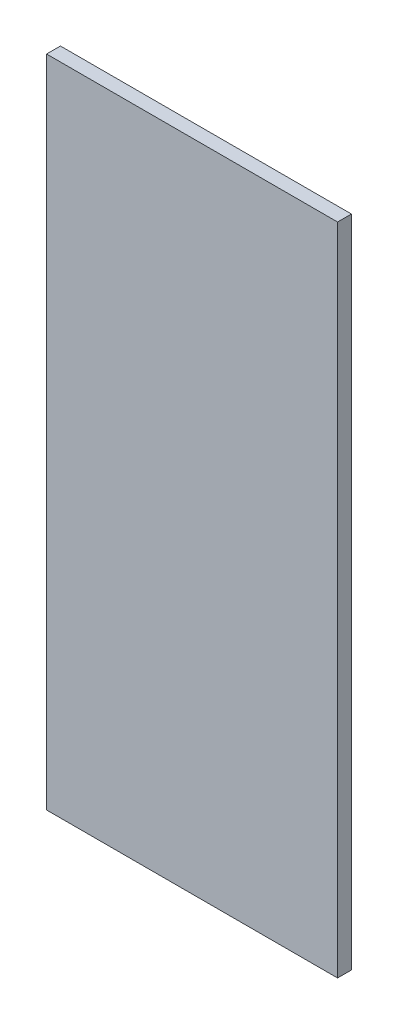
ISO-10303-21;
HEADER;
FILE_DESCRIPTION(('STEP AP214'),'2;1');
FILE_NAME('part.step','',(''),(''),'','','');
FILE_SCHEMA(('AUTOMOTIVE_DESIGN { 1 0 10303 214 1 1 1 1 }'));
ENDSEC;
DATA;
#1=APPLICATION_CONTEXT('core data for automotive mechanical design processes');
#2=APPLICATION_PROTOCOL_DEFINITION('international standard','automotive_design',2000,#1);
#3=PRODUCT_CONTEXT('',#1,'mechanical');
#4=PRODUCT('Part','Part','',(#3));
#5=PRODUCT_RELATED_PRODUCT_CATEGORY('part','',(#4));
#6=PRODUCT_DEFINITION_FORMATION('','',#4);
#7=PRODUCT_DEFINITION_CONTEXT('part definition',#1,'design');
#8=PRODUCT_DEFINITION('design','',#6,#7);
#9=PRODUCT_DEFINITION_SHAPE('','',#8);
#10=(LENGTH_UNIT() NAMED_UNIT(*) SI_UNIT(.MILLI.,.METRE.));
#11=(NAMED_UNIT(*) PLANE_ANGLE_UNIT() SI_UNIT($,.RADIAN.));
#12=(NAMED_UNIT(*) SI_UNIT($,.STERADIAN.) SOLID_ANGLE_UNIT());
#13=UNCERTAINTY_MEASURE_WITH_UNIT(LENGTH_MEASURE(1.E-05),#10,'distance_accuracy_value','');
#14=(GEOMETRIC_REPRESENTATION_CONTEXT(3) GLOBAL_UNCERTAINTY_ASSIGNED_CONTEXT((#13)) GLOBAL_UNIT_ASSIGNED_CONTEXT((#10,
#11,#12)) REPRESENTATION_CONTEXT('',''));
#15=CARTESIAN_POINT('',(0.,0.,0.));
#16=DIRECTION('',(0.,0.,1.));
#17=DIRECTION('',(1.,0.,0.));
#18=AXIS2_PLACEMENT_3D('',#15,#16,#17);
#19=CARTESIAN_POINT('',(0.,0.,19.05));
#20=DIRECTION('',(1.,0.,0.));
#21=DIRECTION('',(0.,1.,0.));
#22=AXIS2_PLACEMENT_3D('',#19,#20,#21);
#23=PLANE('',#22);
#24=DIRECTION('',(0.,-1.,0.));
#25=VECTOR('',#24,1.);
#26=CARTESIAN_POINT('',(0.,0.,0.));
#27=LINE('',#26,#25);
#28=CARTESIAN_POINT('',(0.,0.,0.));
#29=VERTEX_POINT('',#28);
#30=CARTESIAN_POINT('',(1.10218211923262E-13,-900.,0.));
#31=VERTEX_POINT('',#30);
#32=EDGE_CURVE('E101',#29,#31,#27,.T.);
#33=ORIENTED_EDGE('',*,*,#32,.T.);
#34=DIRECTION('',(0.,0.,-1.));
#35=VECTOR('',#34,1.);
#36=CARTESIAN_POINT('',(1.10218211923262E-13,-900.,19.05));
#37=LINE('',#36,#35);
#38=CARTESIAN_POINT('',(1.10218211923262E-13,-900.,19.05));
#39=VERTEX_POINT('',#38);
#40=EDGE_CURVE('E11',#39,#31,#37,.T.);
#41=ORIENTED_EDGE('',*,*,#40,.F.);
#42=DIRECTION('',(0.,-1.,0.));
#43=VECTOR('',#42,1.);
#44=CARTESIAN_POINT('',(0.,0.,19.05));
#45=LINE('',#44,#43);
#46=CARTESIAN_POINT('',(0.,0.,19.05));
#47=VERTEX_POINT('',#46);
#48=EDGE_CURVE('E89',#47,#39,#45,.T.);
#49=ORIENTED_EDGE('',*,*,#48,.F.);
#50=DIRECTION('',(0.,0.,-1.));
#51=VECTOR('',#50,1.);
#52=CARTESIAN_POINT('',(0.,0.,19.05));
#53=LINE('',#52,#51);
#54=EDGE_CURVE('E97',#47,#29,#53,.T.);
#55=ORIENTED_EDGE('',*,*,#54,.T.);
#56=EDGE_LOOP('',(#33,#41,#49,#55));
#57=FACE_BOUND('',#56,.T.);
#58=ADVANCED_FACE('F38',(#57),#23,.F.);
#59=CARTESIAN_POINT('',(1.10218211923262E-13,-900.,19.05));
#60=DIRECTION('',(0.,1.,0.));
#61=DIRECTION('',(0.,0.,1.));
#62=AXIS2_PLACEMENT_3D('',#59,#60,#61);
#63=PLANE('',#62);
#64=DIRECTION('',(1.,0.,0.));
#65=VECTOR('',#64,1.);
#66=CARTESIAN_POINT('',(1.10218211923262E-13,-900.,0.));
#67=LINE('',#66,#65);
#68=CARTESIAN_POINT('',(400.,-900.,0.));
#69=VERTEX_POINT('',#68);
#70=EDGE_CURVE('E93',#31,#69,#67,.T.);
#71=ORIENTED_EDGE('',*,*,#70,.T.);
#72=DIRECTION('',(0.,0.,-1.));
#73=VECTOR('',#72,1.);
#74=CARTESIAN_POINT('',(400.,-900.,19.05));
#75=LINE('',#74,#73);
#76=CARTESIAN_POINT('',(400.,-900.,19.05));
#77=VERTEX_POINT('',#76);
#78=EDGE_CURVE('E46',#77,#69,#75,.T.);
#79=ORIENTED_EDGE('',*,*,#78,.F.);
#80=DIRECTION('',(1.,0.,0.));
#81=VECTOR('',#80,1.);
#82=CARTESIAN_POINT('',(1.10218211923262E-13,-900.,19.05));
#83=LINE('',#82,#81);
#84=EDGE_CURVE('E84',#39,#77,#83,.T.);
#85=ORIENTED_EDGE('',*,*,#84,.F.);
#86=ORIENTED_EDGE('',*,*,#40,.T.);
#87=EDGE_LOOP('',(#71,#79,#85,#86));
#88=FACE_BOUND('',#87,.T.);
#89=ADVANCED_FACE('F92',(#88),#63,.F.);
#90=CARTESIAN_POINT('',(400.,0.,19.05));
#91=DIRECTION('',(-1.,0.,0.));
#92=DIRECTION('',(0.,-1.,0.));
#93=AXIS2_PLACEMENT_3D('',#90,#91,#92);
#94=PLANE('',#93);
#95=DIRECTION('',(0.,1.,0.));
#96=VECTOR('',#95,1.);
#97=CARTESIAN_POINT('',(400.,0.,0.));
#98=LINE('',#97,#96);
#99=CARTESIAN_POINT('',(400.,0.,0.));
#100=VERTEX_POINT('',#99);
#101=EDGE_CURVE('E71',#69,#100,#98,.T.);
#102=ORIENTED_EDGE('',*,*,#101,.T.);
#103=DIRECTION('',(0.,0.,-1.));
#104=VECTOR('',#103,1.);
#105=CARTESIAN_POINT('',(400.,0.,19.05));
#106=LINE('',#105,#104);
#107=CARTESIAN_POINT('',(400.,0.,19.05));
#108=VERTEX_POINT('',#107);
#109=EDGE_CURVE('E94',#108,#100,#106,.T.);
#110=ORIENTED_EDGE('',*,*,#109,.F.);
#111=DIRECTION('',(0.,1.,0.));
#112=VECTOR('',#111,1.);
#113=CARTESIAN_POINT('',(400.,0.,19.05));
#114=LINE('',#113,#112);
#115=EDGE_CURVE('E87',#77,#108,#114,.T.);
#116=ORIENTED_EDGE('',*,*,#115,.F.);
#117=ORIENTED_EDGE('',*,*,#78,.T.);
#118=EDGE_LOOP('',(#102,#110,#116,#117));
#119=FACE_BOUND('',#118,.T.);
#120=ADVANCED_FACE('F95',(#119),#94,.F.);
#121=CARTESIAN_POINT('',(0.,0.,19.05));
#122=DIRECTION('',(0.,-1.,0.));
#123=DIRECTION('',(0.,0.,-1.));
#124=AXIS2_PLACEMENT_3D('',#121,#122,#123);
#125=PLANE('',#124);
#126=DIRECTION('',(-1.,0.,0.));
#127=VECTOR('',#126,1.);
#128=CARTESIAN_POINT('',(0.,0.,0.));
#129=LINE('',#128,#127);
#130=EDGE_CURVE('E77',#100,#29,#129,.T.);
#131=ORIENTED_EDGE('',*,*,#130,.T.);
#132=ORIENTED_EDGE('',*,*,#54,.F.);
#133=DIRECTION('',(-1.,0.,0.));
#134=VECTOR('',#133,1.);
#135=CARTESIAN_POINT('',(0.,0.,19.05));
#136=LINE('',#135,#134);
#137=EDGE_CURVE('E54',#108,#47,#136,.T.);
#138=ORIENTED_EDGE('',*,*,#137,.F.);
#139=ORIENTED_EDGE('',*,*,#109,.T.);
#140=EDGE_LOOP('',(#131,#132,#138,#139));
#141=FACE_BOUND('',#140,.T.);
#142=ADVANCED_FACE('F108',(#141),#125,.F.);
#143=CARTESIAN_POINT('',(0.,0.,19.05));
#144=DIRECTION('',(0.,0.,1.));
#145=DIRECTION('',(1.,0.,0.));
#146=AXIS2_PLACEMENT_3D('',#143,#144,#145);
#147=PLANE('',#146);
#148=ORIENTED_EDGE('',*,*,#48,.T.);
#149=ORIENTED_EDGE('',*,*,#84,.T.);
#150=ORIENTED_EDGE('',*,*,#115,.T.);
#151=ORIENTED_EDGE('',*,*,#137,.T.);
#152=EDGE_LOOP('',(#148,#149,#150,#151));
#153=FACE_BOUND('',#152,.T.);
#154=ADVANCED_FACE('F85',(#153),#147,.T.);
#155=CARTESIAN_POINT('',(0.,0.,0.));
#156=DIRECTION('',(0.,0.,1.));
#157=DIRECTION('',(1.,0.,0.));
#158=AXIS2_PLACEMENT_3D('',#155,#156,#157);
#159=PLANE('',#158);
#160=ORIENTED_EDGE('',*,*,#32,.F.);
#161=ORIENTED_EDGE('',*,*,#130,.F.);
#162=ORIENTED_EDGE('',*,*,#101,.F.);
#163=ORIENTED_EDGE('',*,*,#70,.F.);
#164=EDGE_LOOP('',(#160,#161,#162,#163));
#165=FACE_BOUND('',#164,.T.);
#166=ADVANCED_FACE('F111',(#165),#159,.F.);
#167=CLOSED_SHELL('',(#58,#89,#120,#142,#154,#166));
#168=MANIFOLD_SOLID_BREP('B2',#167);
#169=ADVANCED_BREP_SHAPE_REPRESENTATION('',(#18,#168),#14);
#170=SHAPE_DEFINITION_REPRESENTATION(#9,#169);
ENDSEC;
END-ISO-10303-21;
